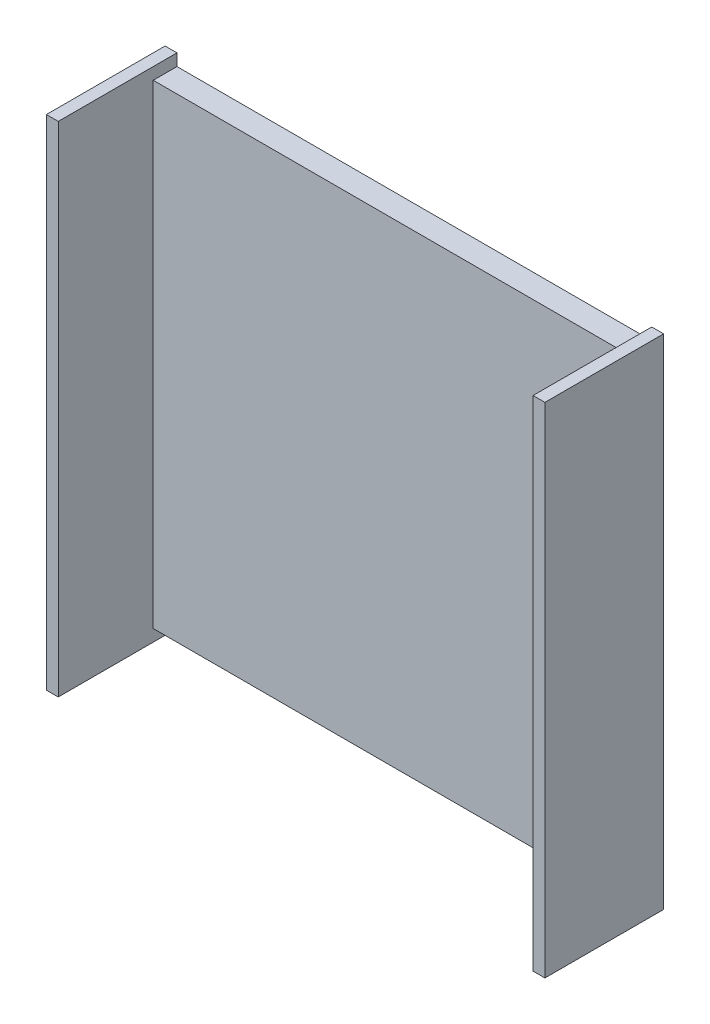
ISO-10303-21;
HEADER;
FILE_DESCRIPTION(('STEP AP214'),'2;1');
FILE_NAME('part.step','',(''),(''),'','','');
FILE_SCHEMA(('AUTOMOTIVE_DESIGN { 1 0 10303 214 1 1 1 1 }'));
ENDSEC;
DATA;
#1=APPLICATION_CONTEXT('core data for automotive mechanical design processes');
#2=APPLICATION_PROTOCOL_DEFINITION('international standard','automotive_design',2000,#1);
#3=PRODUCT_CONTEXT('',#1,'mechanical');
#4=PRODUCT('Part','Part','',(#3));
#5=PRODUCT_RELATED_PRODUCT_CATEGORY('part','',(#4));
#6=PRODUCT_DEFINITION_FORMATION('','',#4);
#7=PRODUCT_DEFINITION_CONTEXT('part definition',#1,'design');
#8=PRODUCT_DEFINITION('design','',#6,#7);
#9=PRODUCT_DEFINITION_SHAPE('','',#8);
#10=(LENGTH_UNIT() NAMED_UNIT(*) SI_UNIT(.MILLI.,.METRE.));
#11=(NAMED_UNIT(*) PLANE_ANGLE_UNIT() SI_UNIT($,.RADIAN.));
#12=(NAMED_UNIT(*) SI_UNIT($,.STERADIAN.) SOLID_ANGLE_UNIT());
#13=UNCERTAINTY_MEASURE_WITH_UNIT(LENGTH_MEASURE(1.E-05),#10,'distance_accuracy_value','');
#14=(GEOMETRIC_REPRESENTATION_CONTEXT(3) GLOBAL_UNCERTAINTY_ASSIGNED_CONTEXT((#13)) GLOBAL_UNIT_ASSIGNED_CONTEXT((#10,
#11,#12)) REPRESENTATION_CONTEXT('',''));
#15=CARTESIAN_POINT('',(0.,0.,0.));
#16=DIRECTION('',(0.,0.,1.));
#17=DIRECTION('',(1.,0.,0.));
#18=AXIS2_PLACEMENT_3D('',#15,#16,#17);
#19=CARTESIAN_POINT('',(0.,0.,10.));
#20=DIRECTION('',(0.,0.,1.));
#21=DIRECTION('',(1.,0.,0.));
#22=AXIS2_PLACEMENT_3D('',#19,#20,#21);
#23=PLANE('',#22);
#24=DIRECTION('',(0.,1.,0.));
#25=VECTOR('',#24,1.);
#26=CARTESIAN_POINT('',(20.,-20.,10.));
#27=LINE('',#26,#25);
#28=CARTESIAN_POINT('',(20.,-21.,10.));
#29=VERTEX_POINT('',#28);
#30=CARTESIAN_POINT('',(20.,21.,10.));
#31=VERTEX_POINT('',#30);
#32=EDGE_CURVE('E193',#29,#31,#27,.T.);
#33=ORIENTED_EDGE('',*,*,#32,.F.);
#34=DIRECTION('',(1.,0.,0.));
#35=VECTOR('',#34,1.);
#36=CARTESIAN_POINT('',(-21.,-21.,10.));
#37=LINE('',#36,#35);
#38=CARTESIAN_POINT('',(21.,-21.,10.));
#39=VERTEX_POINT('',#38);
#40=EDGE_CURVE('E50',#29,#39,#37,.T.);
#41=ORIENTED_EDGE('',*,*,#40,.T.);
#42=DIRECTION('',(0.,1.,0.));
#43=VECTOR('',#42,1.);
#44=CARTESIAN_POINT('',(21.,21.,10.));
#45=LINE('',#44,#43);
#46=CARTESIAN_POINT('',(21.,21.,10.));
#47=VERTEX_POINT('',#46);
#48=EDGE_CURVE('E198',#39,#47,#45,.T.);
#49=ORIENTED_EDGE('',*,*,#48,.T.);
#50=DIRECTION('',(-1.,0.,0.));
#51=VECTOR('',#50,1.);
#52=CARTESIAN_POINT('',(-21.,21.,10.));
#53=LINE('',#52,#51);
#54=EDGE_CURVE('E83',#47,#31,#53,.T.);
#55=ORIENTED_EDGE('',*,*,#54,.T.);
#56=EDGE_LOOP('',(#33,#41,#49,#55));
#57=FACE_BOUND('',#56,.T.);
#58=ADVANCED_FACE('F33',(#57),#23,.T.);
#59=CARTESIAN_POINT('',(-21.,-21.,10.));
#60=DIRECTION('',(0.,1.,0.));
#61=DIRECTION('',(0.,0.,1.));
#62=AXIS2_PLACEMENT_3D('',#59,#60,#61);
#63=PLANE('',#62);
#64=ORIENTED_EDGE('',*,*,#40,.F.);
#65=DIRECTION('',(0.,0.,1.));
#66=VECTOR('',#65,1.);
#67=CARTESIAN_POINT('',(20.,-21.,0.));
#68=LINE('',#67,#66);
#69=CARTESIAN_POINT('',(20.,-21.,0.));
#70=VERTEX_POINT('',#69);
#71=EDGE_CURVE('E160',#70,#29,#68,.T.);
#72=ORIENTED_EDGE('',*,*,#71,.F.);
#73=DIRECTION('',(1.,0.,0.));
#74=VECTOR('',#73,1.);
#75=CARTESIAN_POINT('',(-21.,-21.,0.));
#76=LINE('',#75,#74);
#77=CARTESIAN_POINT('',(21.,-21.,0.));
#78=VERTEX_POINT('',#77);
#79=EDGE_CURVE('E76',#70,#78,#76,.T.);
#80=ORIENTED_EDGE('',*,*,#79,.T.);
#81=DIRECTION('',(0.,0.,-1.));
#82=VECTOR('',#81,1.);
#83=CARTESIAN_POINT('',(21.,-21.,10.));
#84=LINE('',#83,#82);
#85=EDGE_CURVE('E208',#39,#78,#84,.T.);
#86=ORIENTED_EDGE('',*,*,#85,.F.);
#87=EDGE_LOOP('',(#64,#72,#80,#86));
#88=FACE_BOUND('',#87,.T.);
#89=ADVANCED_FACE('F245',(#88),#63,.F.);
#90=CARTESIAN_POINT('',(-21.,21.,10.));
#91=DIRECTION('',(0.,-1.,0.));
#92=DIRECTION('',(0.,0.,-1.));
#93=AXIS2_PLACEMENT_3D('',#90,#91,#92);
#94=PLANE('',#93);
#95=CARTESIAN_POINT('',(-20.,21.,10.));
#96=VERTEX_POINT('',#95);
#97=CARTESIAN_POINT('',(-21.,21.,10.));
#98=VERTEX_POINT('',#97);
#99=EDGE_CURVE('E200',#96,#98,#53,.T.);
#100=ORIENTED_EDGE('',*,*,#99,.F.);
#101=DIRECTION('',(0.,0.,1.));
#102=VECTOR('',#101,1.);
#103=CARTESIAN_POINT('',(-20.,21.,0.));
#104=LINE('',#103,#102);
#105=CARTESIAN_POINT('',(-20.,21.,0.));
#106=VERTEX_POINT('',#105);
#107=EDGE_CURVE('E176',#106,#96,#104,.T.);
#108=ORIENTED_EDGE('',*,*,#107,.F.);
#109=DIRECTION('',(-1.,0.,0.));
#110=VECTOR('',#109,1.);
#111=CARTESIAN_POINT('',(-21.,21.,0.));
#112=LINE('',#111,#110);
#113=CARTESIAN_POINT('',(-21.,21.,0.));
#114=VERTEX_POINT('',#113);
#115=EDGE_CURVE('E211',#106,#114,#112,.T.);
#116=ORIENTED_EDGE('',*,*,#115,.T.);
#117=DIRECTION('',(0.,0.,-1.));
#118=VECTOR('',#117,1.);
#119=CARTESIAN_POINT('',(-21.,21.,10.));
#120=LINE('',#119,#118);
#121=EDGE_CURVE('E42',#98,#114,#120,.T.);
#122=ORIENTED_EDGE('',*,*,#121,.F.);
#123=EDGE_LOOP('',(#100,#108,#116,#122));
#124=FACE_BOUND('',#123,.T.);
#125=ADVANCED_FACE('F233',(#124),#94,.F.);
#126=CARTESIAN_POINT('',(20.,-20.,10.));
#127=DIRECTION('',(-1.,0.,0.));
#128=DIRECTION('',(0.,0.,1.));
#129=AXIS2_PLACEMENT_3D('',#126,#127,#128);
#130=PLANE('',#129);
#131=ORIENTED_EDGE('',*,*,#32,.T.);
#132=DIRECTION('',(0.,0.,1.));
#133=VECTOR('',#132,1.);
#134=CARTESIAN_POINT('',(20.,21.,0.));
#135=LINE('',#134,#133);
#136=CARTESIAN_POINT('',(20.,21.,0.));
#137=VERTEX_POINT('',#136);
#138=EDGE_CURVE('E180',#137,#31,#135,.T.);
#139=ORIENTED_EDGE('',*,*,#138,.F.);
#140=DIRECTION('',(0.,1.,0.));
#141=VECTOR('',#140,1.);
#142=CARTESIAN_POINT('',(20.,20.,0.));
#143=LINE('',#142,#141);
#144=CARTESIAN_POINT('',(20.,20.,0.));
#145=VERTEX_POINT('',#144);
#146=EDGE_CURVE('E172',#145,#137,#143,.T.);
#147=ORIENTED_EDGE('',*,*,#146,.F.);
#148=DIRECTION('',(0.,0.,1.));
#149=VECTOR('',#148,1.);
#150=CARTESIAN_POINT('',(20.,20.,0.));
#151=LINE('',#150,#149);
#152=CARTESIAN_POINT('',(20.,20.,2.));
#153=VERTEX_POINT('',#152);
#154=EDGE_CURVE('E182',#145,#153,#151,.T.);
#155=ORIENTED_EDGE('',*,*,#154,.T.);
#156=DIRECTION('',(0.,-1.,0.));
#157=VECTOR('',#156,1.);
#158=CARTESIAN_POINT('',(20.,20.,2.));
#159=LINE('',#158,#157);
#160=CARTESIAN_POINT('',(20.,-20.,1.99999999999999));
#161=VERTEX_POINT('',#160);
#162=EDGE_CURVE('E141',#153,#161,#159,.T.);
#163=ORIENTED_EDGE('',*,*,#162,.T.);
#164=DIRECTION('',(0.,0.,1.));
#165=VECTOR('',#164,1.);
#166=CARTESIAN_POINT('',(20.,-20.,0.));
#167=LINE('',#166,#165);
#168=CARTESIAN_POINT('',(20.,-20.,0.));
#169=VERTEX_POINT('',#168);
#170=EDGE_CURVE('E133',#169,#161,#167,.T.);
#171=ORIENTED_EDGE('',*,*,#170,.F.);
#172=DIRECTION('',(0.,1.,0.));
#173=VECTOR('',#172,1.);
#174=CARTESIAN_POINT('',(20.,-20.,0.));
#175=LINE('',#174,#173);
#176=EDGE_CURVE('E138',#70,#169,#175,.T.);
#177=ORIENTED_EDGE('',*,*,#176,.F.);
#178=ORIENTED_EDGE('',*,*,#71,.T.);
#179=EDGE_LOOP('',(#131,#139,#147,#155,#163,#171,#177,#178));
#180=FACE_BOUND('',#179,.T.);
#181=ADVANCED_FACE('F135',(#180),#130,.T.);
#182=CARTESIAN_POINT('',(-20.,-20.,10.));
#183=DIRECTION('',(1.,0.,0.));
#184=DIRECTION('',(0.,0.,-1.));
#185=AXIS2_PLACEMENT_3D('',#182,#183,#184);
#186=PLANE('',#185);
#187=DIRECTION('',(0.,-1.,0.));
#188=VECTOR('',#187,1.);
#189=CARTESIAN_POINT('',(-20.,-20.,10.));
#190=LINE('',#189,#188);
#191=CARTESIAN_POINT('',(-20.,-21.,10.));
#192=VERTEX_POINT('',#191);
#193=EDGE_CURVE('E195',#96,#192,#190,.T.);
#194=ORIENTED_EDGE('',*,*,#193,.T.);
#195=DIRECTION('',(0.,0.,1.));
#196=VECTOR('',#195,1.);
#197=CARTESIAN_POINT('',(-20.,-21.,0.));
#198=LINE('',#197,#196);
#199=CARTESIAN_POINT('',(-20.,-21.,0.));
#200=VERTEX_POINT('',#199);
#201=EDGE_CURVE('E163',#200,#192,#198,.T.);
#202=ORIENTED_EDGE('',*,*,#201,.F.);
#203=DIRECTION('',(0.,-1.,0.));
#204=VECTOR('',#203,1.);
#205=CARTESIAN_POINT('',(-20.,-20.,0.));
#206=LINE('',#205,#204);
#207=CARTESIAN_POINT('',(-20.,-20.,0.));
#208=VERTEX_POINT('',#207);
#209=EDGE_CURVE('E145',#208,#200,#206,.T.);
#210=ORIENTED_EDGE('',*,*,#209,.F.);
#211=DIRECTION('',(0.,0.,1.));
#212=VECTOR('',#211,1.);
#213=CARTESIAN_POINT('',(-20.,-20.,0.));
#214=LINE('',#213,#212);
#215=CARTESIAN_POINT('',(-20.,-20.,1.99999999999999));
#216=VERTEX_POINT('',#215);
#217=EDGE_CURVE('E144',#208,#216,#214,.T.);
#218=ORIENTED_EDGE('',*,*,#217,.T.);
#219=DIRECTION('',(0.,-1.,0.));
#220=VECTOR('',#219,1.);
#221=CARTESIAN_POINT('',(-20.,20.,2.));
#222=LINE('',#221,#220);
#223=CARTESIAN_POINT('',(-20.,20.,2.));
#224=VERTEX_POINT('',#223);
#225=EDGE_CURVE('E179',#224,#216,#222,.T.);
#226=ORIENTED_EDGE('',*,*,#225,.F.);
#227=DIRECTION('',(0.,0.,1.));
#228=VECTOR('',#227,1.);
#229=CARTESIAN_POINT('',(-20.,20.,0.));
#230=LINE('',#229,#228);
#231=CARTESIAN_POINT('',(-20.,20.,0.));
#232=VERTEX_POINT('',#231);
#233=EDGE_CURVE('E175',#232,#224,#230,.T.);
#234=ORIENTED_EDGE('',*,*,#233,.F.);
#235=DIRECTION('',(0.,-1.,0.));
#236=VECTOR('',#235,1.);
#237=CARTESIAN_POINT('',(-20.,20.,0.));
#238=LINE('',#237,#236);
#239=EDGE_CURVE('E162',#106,#232,#238,.T.);
#240=ORIENTED_EDGE('',*,*,#239,.F.);
#241=ORIENTED_EDGE('',*,*,#107,.T.);
#242=EDGE_LOOP('',(#194,#202,#210,#218,#226,#234,#240,#241));
#243=FACE_BOUND('',#242,.T.);
#244=ADVANCED_FACE('F235',(#243),#186,.T.);
#245=CARTESIAN_POINT('',(-21.,-21.,10.));
#246=VERTEX_POINT('',#245);
#247=EDGE_CURVE('E205',#246,#192,#37,.T.);
#248=ORIENTED_EDGE('',*,*,#247,.T.);
#249=ORIENTED_EDGE('',*,*,#193,.F.);
#250=ORIENTED_EDGE('',*,*,#99,.T.);
#251=DIRECTION('',(0.,-1.,0.));
#252=VECTOR('',#251,1.);
#253=CARTESIAN_POINT('',(-21.,21.,10.));
#254=LINE('',#253,#252);
#255=EDGE_CURVE('E203',#98,#246,#254,.T.);
#256=ORIENTED_EDGE('',*,*,#255,.T.);
#257=EDGE_LOOP('',(#248,#249,#250,#256));
#258=FACE_BOUND('',#257,.T.);
#259=ADVANCED_FACE('F231',(#258),#23,.T.);
#260=CARTESIAN_POINT('',(0.,0.,0.));
#261=DIRECTION('',(0.,0.,1.));
#262=DIRECTION('',(1.,0.,0.));
#263=AXIS2_PLACEMENT_3D('',#260,#261,#262);
#264=PLANE('',#263);
#265=ORIENTED_EDGE('',*,*,#79,.F.);
#266=ORIENTED_EDGE('',*,*,#176,.T.);
#267=DIRECTION('',(-1.,0.,0.));
#268=VECTOR('',#267,1.);
#269=CARTESIAN_POINT('',(20.,-20.,0.));
#270=LINE('',#269,#268);
#271=EDGE_CURVE('E148',#169,#208,#270,.T.);
#272=ORIENTED_EDGE('',*,*,#271,.T.);
#273=ORIENTED_EDGE('',*,*,#209,.T.);
#274=CARTESIAN_POINT('',(-21.,-21.,0.));
#275=VERTEX_POINT('',#274);
#276=EDGE_CURVE('E201',#275,#200,#76,.T.);
#277=ORIENTED_EDGE('',*,*,#276,.F.);
#278=DIRECTION('',(0.,-1.,0.));
#279=VECTOR('',#278,1.);
#280=CARTESIAN_POINT('',(-21.,21.,0.));
#281=LINE('',#280,#279);
#282=EDGE_CURVE('E69',#114,#275,#281,.T.);
#283=ORIENTED_EDGE('',*,*,#282,.F.);
#284=ORIENTED_EDGE('',*,*,#115,.F.);
#285=ORIENTED_EDGE('',*,*,#239,.T.);
#286=DIRECTION('',(1.,0.,0.));
#287=VECTOR('',#286,1.);
#288=CARTESIAN_POINT('',(-20.,20.,0.));
#289=LINE('',#288,#287);
#290=EDGE_CURVE('E169',#232,#145,#289,.T.);
#291=ORIENTED_EDGE('',*,*,#290,.T.);
#292=ORIENTED_EDGE('',*,*,#146,.T.);
#293=CARTESIAN_POINT('',(21.,21.,0.));
#294=VERTEX_POINT('',#293);
#295=EDGE_CURVE('E212',#294,#137,#112,.T.);
#296=ORIENTED_EDGE('',*,*,#295,.F.);
#297=DIRECTION('',(0.,1.,0.));
#298=VECTOR('',#297,1.);
#299=CARTESIAN_POINT('',(21.,21.,0.));
#300=LINE('',#299,#298);
#301=EDGE_CURVE('E197',#78,#294,#300,.T.);
#302=ORIENTED_EDGE('',*,*,#301,.F.);
#303=EDGE_LOOP('',(#265,#266,#272,#273,#277,#283,#284,#285,#291,#292,#296,#302));
#304=FACE_BOUND('',#303,.T.);
#305=ADVANCED_FACE('F155',(#304),#264,.F.);
#306=CARTESIAN_POINT('',(21.,21.,10.));
#307=DIRECTION('',(-1.,0.,0.));
#308=DIRECTION('',(0.,-1.,0.));
#309=AXIS2_PLACEMENT_3D('',#306,#307,#308);
#310=PLANE('',#309);
#311=ORIENTED_EDGE('',*,*,#301,.T.);
#312=DIRECTION('',(0.,0.,-1.));
#313=VECTOR('',#312,1.);
#314=CARTESIAN_POINT('',(21.,21.,10.));
#315=LINE('',#314,#313);
#316=EDGE_CURVE('E11',#47,#294,#315,.T.);
#317=ORIENTED_EDGE('',*,*,#316,.F.);
#318=ORIENTED_EDGE('',*,*,#48,.F.);
#319=ORIENTED_EDGE('',*,*,#85,.T.);
#320=EDGE_LOOP('',(#311,#317,#318,#319));
#321=FACE_BOUND('',#320,.T.);
#322=ADVANCED_FACE('F35',(#321),#310,.F.);
#323=ORIENTED_EDGE('',*,*,#295,.T.);
#324=ORIENTED_EDGE('',*,*,#138,.T.);
#325=ORIENTED_EDGE('',*,*,#54,.F.);
#326=ORIENTED_EDGE('',*,*,#316,.T.);
#327=EDGE_LOOP('',(#323,#324,#325,#326));
#328=FACE_BOUND('',#327,.T.);
#329=ADVANCED_FACE('F241',(#328),#94,.F.);
#330=CARTESIAN_POINT('',(-21.,21.,10.));
#331=DIRECTION('',(1.,0.,0.));
#332=DIRECTION('',(0.,1.,0.));
#333=AXIS2_PLACEMENT_3D('',#330,#331,#332);
#334=PLANE('',#333);
#335=ORIENTED_EDGE('',*,*,#282,.T.);
#336=DIRECTION('',(0.,0.,-1.));
#337=VECTOR('',#336,1.);
#338=CARTESIAN_POINT('',(-21.,-21.,10.));
#339=LINE('',#338,#337);
#340=EDGE_CURVE('E219',#246,#275,#339,.T.);
#341=ORIENTED_EDGE('',*,*,#340,.F.);
#342=ORIENTED_EDGE('',*,*,#255,.F.);
#343=ORIENTED_EDGE('',*,*,#121,.T.);
#344=EDGE_LOOP('',(#335,#341,#342,#343));
#345=FACE_BOUND('',#344,.T.);
#346=ADVANCED_FACE('F222',(#345),#334,.F.);
#347=ORIENTED_EDGE('',*,*,#276,.T.);
#348=ORIENTED_EDGE('',*,*,#201,.T.);
#349=ORIENTED_EDGE('',*,*,#247,.F.);
#350=ORIENTED_EDGE('',*,*,#340,.T.);
#351=EDGE_LOOP('',(#347,#348,#349,#350));
#352=FACE_BOUND('',#351,.T.);
#353=ADVANCED_FACE('F228',(#352),#63,.F.);
#354=CARTESIAN_POINT('',(20.,20.,2.));
#355=DIRECTION('',(0.,0.,-1.));
#356=DIRECTION('',(0.,1.,0.));
#357=AXIS2_PLACEMENT_3D('',#354,#355,#356);
#358=PLANE('',#357);
#359=ORIENTED_EDGE('',*,*,#225,.T.);
#360=DIRECTION('',(-1.,0.,0.));
#361=VECTOR('',#360,1.);
#362=CARTESIAN_POINT('',(20.,-20.,1.99999999999999));
#363=LINE('',#362,#361);
#364=EDGE_CURVE('E186',#161,#216,#363,.T.);
#365=ORIENTED_EDGE('',*,*,#364,.F.);
#366=ORIENTED_EDGE('',*,*,#162,.F.);
#367=DIRECTION('',(-1.,0.,0.));
#368=VECTOR('',#367,1.);
#369=CARTESIAN_POINT('',(20.,20.,2.));
#370=LINE('',#369,#368);
#371=EDGE_CURVE('E190',#153,#224,#370,.T.);
#372=ORIENTED_EDGE('',*,*,#371,.T.);
#373=EDGE_LOOP('',(#359,#365,#366,#372));
#374=FACE_BOUND('',#373,.T.);
#375=ADVANCED_FACE('F256',(#374),#358,.F.);
#376=CARTESIAN_POINT('',(-20.,20.,0.));
#377=DIRECTION('',(0.,-1.,0.));
#378=DIRECTION('',(0.,0.,-1.));
#379=AXIS2_PLACEMENT_3D('',#376,#377,#378);
#380=PLANE('',#379);
#381=ORIENTED_EDGE('',*,*,#154,.F.);
#382=ORIENTED_EDGE('',*,*,#290,.F.);
#383=ORIENTED_EDGE('',*,*,#233,.T.);
#384=ORIENTED_EDGE('',*,*,#371,.F.);
#385=EDGE_LOOP('',(#381,#382,#383,#384));
#386=FACE_BOUND('',#385,.T.);
#387=ADVANCED_FACE('F240',(#386),#380,.F.);
#388=CARTESIAN_POINT('',(20.,-20.,0.));
#389=DIRECTION('',(0.,1.,0.));
#390=DIRECTION('',(-1.,0.,0.));
#391=AXIS2_PLACEMENT_3D('',#388,#389,#390);
#392=PLANE('',#391);
#393=ORIENTED_EDGE('',*,*,#217,.F.);
#394=ORIENTED_EDGE('',*,*,#271,.F.);
#395=ORIENTED_EDGE('',*,*,#170,.T.);
#396=ORIENTED_EDGE('',*,*,#364,.T.);
#397=EDGE_LOOP('',(#393,#394,#395,#396));
#398=FACE_BOUND('',#397,.T.);
#399=ADVANCED_FACE('F149',(#398),#392,.F.);
#400=CLOSED_SHELL('',(#58,#89,#125,#181,#244,#259,#305,#322,#329,#346,#353,#375,#387,#399));
#401=MANIFOLD_SOLID_BREP('B2',#400);
#402=ADVANCED_BREP_SHAPE_REPRESENTATION('',(#18,#401),#14);
#403=SHAPE_DEFINITION_REPRESENTATION(#9,#402);
ENDSEC;
END-ISO-10303-21;
